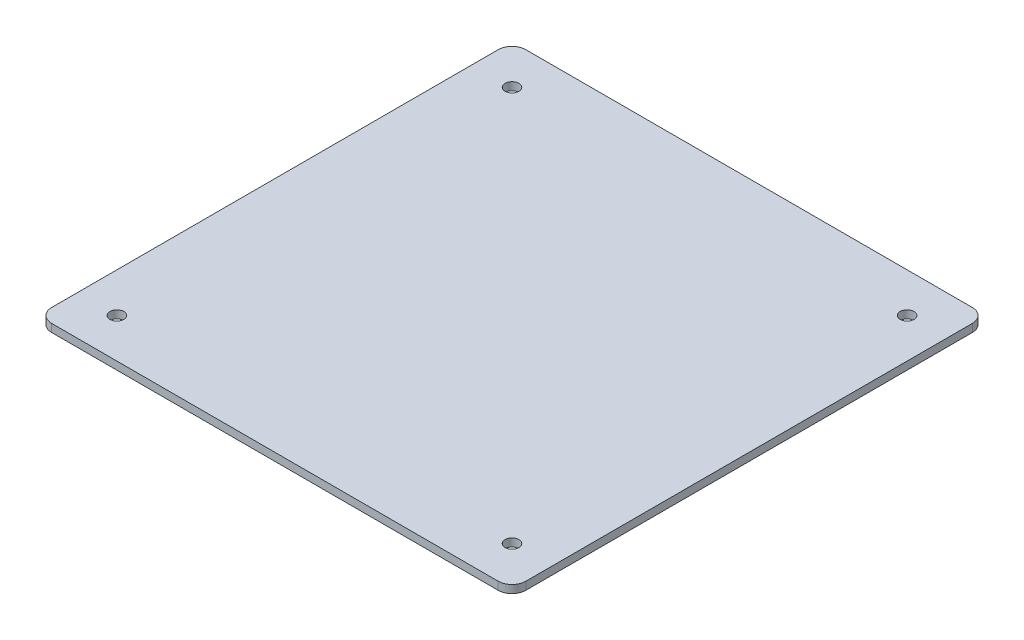
ISO-10303-21;
HEADER;
FILE_DESCRIPTION(('STEP AP214'),'2;1');
FILE_NAME('part.step','',(''),(''),'','','');
FILE_SCHEMA(('AUTOMOTIVE_DESIGN { 1 0 10303 214 1 1 1 1 }'));
ENDSEC;
DATA;
#1=APPLICATION_CONTEXT('core data for automotive mechanical design processes');
#2=APPLICATION_PROTOCOL_DEFINITION('international standard','automotive_design',2000,#1);
#3=PRODUCT_CONTEXT('',#1,'mechanical');
#4=PRODUCT('Part','Part','',(#3));
#5=PRODUCT_RELATED_PRODUCT_CATEGORY('part','',(#4));
#6=PRODUCT_DEFINITION_FORMATION('','',#4);
#7=PRODUCT_DEFINITION_CONTEXT('part definition',#1,'design');
#8=PRODUCT_DEFINITION('design','',#6,#7);
#9=PRODUCT_DEFINITION_SHAPE('','',#8);
#10=(LENGTH_UNIT() NAMED_UNIT(*) SI_UNIT(.MILLI.,.METRE.));
#11=(NAMED_UNIT(*) PLANE_ANGLE_UNIT() SI_UNIT($,.RADIAN.));
#12=(NAMED_UNIT(*) SI_UNIT($,.STERADIAN.) SOLID_ANGLE_UNIT());
#13=UNCERTAINTY_MEASURE_WITH_UNIT(LENGTH_MEASURE(1.E-05),#10,'distance_accuracy_value','');
#14=(GEOMETRIC_REPRESENTATION_CONTEXT(3) GLOBAL_UNCERTAINTY_ASSIGNED_CONTEXT((#13)) GLOBAL_UNIT_ASSIGNED_CONTEXT((#10,
#11,#12)) REPRESENTATION_CONTEXT('',''));
#15=CARTESIAN_POINT('',(0.,0.,0.));
#16=DIRECTION('',(0.,0.,1.));
#17=DIRECTION('',(1.,0.,0.));
#18=AXIS2_PLACEMENT_3D('',#15,#16,#17);
#19=CARTESIAN_POINT('',(60.,2.,-60.));
#20=DIRECTION('',(-1.,0.,0.));
#21=DIRECTION('',(0.,0.,1.));
#22=AXIS2_PLACEMENT_3D('',#19,#20,#21);
#23=PLANE('',#22);
#24=DIRECTION('',(0.,0.,-1.));
#25=VECTOR('',#24,1.);
#26=CARTESIAN_POINT('',(60.,0.,-60.));
#27=LINE('',#26,#25);
#28=CARTESIAN_POINT('',(60.,0.,56.5));
#29=VERTEX_POINT('',#28);
#30=CARTESIAN_POINT('',(60.,0.,-56.5));
#31=VERTEX_POINT('',#30);
#32=EDGE_CURVE('E130',#29,#31,#27,.T.);
#33=ORIENTED_EDGE('',*,*,#32,.T.);
#34=DIRECTION('',(0.,-1.,0.));
#35=VECTOR('',#34,1.);
#36=CARTESIAN_POINT('',(60.,2.,-56.5));
#37=LINE('',#36,#35);
#38=CARTESIAN_POINT('',(60.,2.,-56.5));
#39=VERTEX_POINT('',#38);
#40=EDGE_CURVE('E152',#31,#39,#37,.F.);
#41=ORIENTED_EDGE('',*,*,#40,.T.);
#42=DIRECTION('',(0.,0.,-1.));
#43=VECTOR('',#42,1.);
#44=CARTESIAN_POINT('',(60.,2.,-60.));
#45=LINE('',#44,#43);
#46=CARTESIAN_POINT('',(60.,2.,56.5));
#47=VERTEX_POINT('',#46);
#48=EDGE_CURVE('E128',#47,#39,#45,.T.);
#49=ORIENTED_EDGE('',*,*,#48,.F.);
#50=DIRECTION('',(0.,-1.,0.));
#51=VECTOR('',#50,1.);
#52=CARTESIAN_POINT('',(60.,2.,56.5));
#53=LINE('',#52,#51);
#54=EDGE_CURVE('E149',#47,#29,#53,.T.);
#55=ORIENTED_EDGE('',*,*,#54,.T.);
#56=EDGE_LOOP('',(#33,#41,#49,#55));
#57=FACE_BOUND('',#56,.T.);
#58=ADVANCED_FACE('F33',(#57),#23,.F.);
#59=CARTESIAN_POINT('',(-60.,2.,-60.));
#60=DIRECTION('',(0.,0.,1.));
#61=DIRECTION('',(1.,0.,0.));
#62=AXIS2_PLACEMENT_3D('',#59,#60,#61);
#63=PLANE('',#62);
#64=DIRECTION('',(-1.,0.,0.));
#65=VECTOR('',#64,1.);
#66=CARTESIAN_POINT('',(-60.,0.,-60.));
#67=LINE('',#66,#65);
#68=CARTESIAN_POINT('',(56.5,0.,-60.));
#69=VERTEX_POINT('',#68);
#70=CARTESIAN_POINT('',(-56.5,0.,-60.));
#71=VERTEX_POINT('',#70);
#72=EDGE_CURVE('E126',#69,#71,#67,.T.);
#73=ORIENTED_EDGE('',*,*,#72,.T.);
#74=DIRECTION('',(0.,-1.,0.));
#75=VECTOR('',#74,1.);
#76=CARTESIAN_POINT('',(-56.5,2.,-60.));
#77=LINE('',#76,#75);
#78=CARTESIAN_POINT('',(-56.5,2.,-60.));
#79=VERTEX_POINT('',#78);
#80=EDGE_CURVE('E104',#71,#79,#77,.F.);
#81=ORIENTED_EDGE('',*,*,#80,.T.);
#82=DIRECTION('',(-1.,0.,0.));
#83=VECTOR('',#82,1.);
#84=CARTESIAN_POINT('',(-60.,2.,-60.));
#85=LINE('',#84,#83);
#86=CARTESIAN_POINT('',(56.5,2.,-60.));
#87=VERTEX_POINT('',#86);
#88=EDGE_CURVE('E166',#87,#79,#85,.T.);
#89=ORIENTED_EDGE('',*,*,#88,.F.);
#90=DIRECTION('',(0.,-1.,0.));
#91=VECTOR('',#90,1.);
#92=CARTESIAN_POINT('',(56.5,2.,-60.));
#93=LINE('',#92,#91);
#94=EDGE_CURVE('E109',#87,#69,#93,.T.);
#95=ORIENTED_EDGE('',*,*,#94,.T.);
#96=EDGE_LOOP('',(#73,#81,#89,#95));
#97=FACE_BOUND('',#96,.T.);
#98=ADVANCED_FACE('F171',(#97),#63,.F.);
#99=CARTESIAN_POINT('',(-60.,2.,-60.));
#100=DIRECTION('',(1.,0.,0.));
#101=DIRECTION('',(0.,0.,-1.));
#102=AXIS2_PLACEMENT_3D('',#99,#100,#101);
#103=PLANE('',#102);
#104=DIRECTION('',(0.,0.,1.));
#105=VECTOR('',#104,1.);
#106=CARTESIAN_POINT('',(-60.,2.,-60.));
#107=LINE('',#106,#105);
#108=CARTESIAN_POINT('',(-60.,2.,-56.5));
#109=VERTEX_POINT('',#108);
#110=CARTESIAN_POINT('',(-60.,2.,56.5));
#111=VERTEX_POINT('',#110);
#112=EDGE_CURVE('E118',#109,#111,#107,.T.);
#113=ORIENTED_EDGE('',*,*,#112,.F.);
#114=DIRECTION('',(0.,-1.,0.));
#115=VECTOR('',#114,1.);
#116=CARTESIAN_POINT('',(-60.,2.,-56.5));
#117=LINE('',#116,#115);
#118=CARTESIAN_POINT('',(-60.,0.,-56.5));
#119=VERTEX_POINT('',#118);
#120=EDGE_CURVE('E103',#109,#119,#117,.T.);
#121=ORIENTED_EDGE('',*,*,#120,.T.);
#122=DIRECTION('',(0.,0.,1.));
#123=VECTOR('',#122,1.);
#124=CARTESIAN_POINT('',(-60.,0.,-60.));
#125=LINE('',#124,#123);
#126=CARTESIAN_POINT('',(-60.,0.,56.5));
#127=VERTEX_POINT('',#126);
#128=EDGE_CURVE('E116',#119,#127,#125,.T.);
#129=ORIENTED_EDGE('',*,*,#128,.T.);
#130=DIRECTION('',(0.,-1.,0.));
#131=VECTOR('',#130,1.);
#132=CARTESIAN_POINT('',(-60.,2.,56.5));
#133=LINE('',#132,#131);
#134=EDGE_CURVE('E120',#127,#111,#133,.F.);
#135=ORIENTED_EDGE('',*,*,#134,.T.);
#136=EDGE_LOOP('',(#113,#121,#129,#135));
#137=FACE_BOUND('',#136,.T.);
#138=ADVANCED_FACE('F115',(#137),#103,.F.);
#139=CARTESIAN_POINT('',(-60.,2.,60.));
#140=DIRECTION('',(0.,0.,-1.));
#141=DIRECTION('',(-1.,0.,0.));
#142=AXIS2_PLACEMENT_3D('',#139,#140,#141);
#143=PLANE('',#142);
#144=DIRECTION('',(1.,0.,0.));
#145=VECTOR('',#144,1.);
#146=CARTESIAN_POINT('',(-60.,2.,60.));
#147=LINE('',#146,#145);
#148=CARTESIAN_POINT('',(-56.5,2.,60.));
#149=VERTEX_POINT('',#148);
#150=CARTESIAN_POINT('',(56.5,2.,60.));
#151=VERTEX_POINT('',#150);
#152=EDGE_CURVE('E134',#149,#151,#147,.T.);
#153=ORIENTED_EDGE('',*,*,#152,.F.);
#154=DIRECTION('',(0.,-1.,0.));
#155=VECTOR('',#154,1.);
#156=CARTESIAN_POINT('',(-56.5,2.,60.));
#157=LINE('',#156,#155);
#158=CARTESIAN_POINT('',(-56.5,0.,60.));
#159=VERTEX_POINT('',#158);
#160=EDGE_CURVE('E11',#149,#159,#157,.T.);
#161=ORIENTED_EDGE('',*,*,#160,.T.);
#162=DIRECTION('',(1.,0.,0.));
#163=VECTOR('',#162,1.);
#164=CARTESIAN_POINT('',(-60.,0.,60.));
#165=LINE('',#164,#163);
#166=CARTESIAN_POINT('',(56.5,0.,60.));
#167=VERTEX_POINT('',#166);
#168=EDGE_CURVE('E125',#159,#167,#165,.T.);
#169=ORIENTED_EDGE('',*,*,#168,.T.);
#170=DIRECTION('',(0.,-1.,0.));
#171=VECTOR('',#170,1.);
#172=CARTESIAN_POINT('',(56.5,2.,60.));
#173=LINE('',#172,#171);
#174=EDGE_CURVE('E41',#167,#151,#173,.F.);
#175=ORIENTED_EDGE('',*,*,#174,.T.);
#176=EDGE_LOOP('',(#153,#161,#169,#175));
#177=FACE_BOUND('',#176,.T.);
#178=ADVANCED_FACE('F213',(#177),#143,.F.);
#179=CARTESIAN_POINT('',(0.,2.,0.));
#180=DIRECTION('',(0.,1.,0.));
#181=DIRECTION('',(0.,0.,1.));
#182=AXIS2_PLACEMENT_3D('',#179,#180,#181);
#183=PLANE('',#182);
#184=CARTESIAN_POINT('',(50.,2.,-50.));
#185=DIRECTION('',(0.,1.,0.));
#186=DIRECTION('',(0.,0.,-1.));
#187=AXIS2_PLACEMENT_3D('',#184,#185,#186);
#188=CIRCLE('',#187,1.74999999999998);
#189=CARTESIAN_POINT('',(50.,2.,-51.75));
#190=VERTEX_POINT('',#189);
#191=EDGE_CURVE('E183',#190,#190,#188,.T.);
#192=ORIENTED_EDGE('',*,*,#191,.F.);
#193=EDGE_LOOP('',(#192));
#194=FACE_BOUND('',#193,.T.);
#195=CARTESIAN_POINT('',(50.,2.,50.));
#196=DIRECTION('',(0.,1.,0.));
#197=DIRECTION('',(0.,0.,1.));
#198=AXIS2_PLACEMENT_3D('',#195,#196,#197);
#199=CIRCLE('',#198,1.74999999999999);
#200=CARTESIAN_POINT('',(50.,2.,51.75));
#201=VERTEX_POINT('',#200);
#202=EDGE_CURVE('E189',#201,#201,#199,.T.);
#203=ORIENTED_EDGE('',*,*,#202,.F.);
#204=EDGE_LOOP('',(#203));
#205=FACE_BOUND('',#204,.T.);
#206=CARTESIAN_POINT('',(-50.,2.,50.));
#207=DIRECTION('',(0.,1.,0.));
#208=DIRECTION('',(0.,0.,-1.));
#209=AXIS2_PLACEMENT_3D('',#206,#207,#208);
#210=CIRCLE('',#209,1.74999999999999);
#211=CARTESIAN_POINT('',(-50.,2.,48.25));
#212=VERTEX_POINT('',#211);
#213=EDGE_CURVE('E195',#212,#212,#210,.T.);
#214=ORIENTED_EDGE('',*,*,#213,.F.);
#215=EDGE_LOOP('',(#214));
#216=FACE_BOUND('',#215,.T.);
#217=CARTESIAN_POINT('',(-50.,2.,-50.));
#218=DIRECTION('',(0.,1.,0.));
#219=DIRECTION('',(0.,0.,1.));
#220=AXIS2_PLACEMENT_3D('',#217,#218,#219);
#221=CIRCLE('',#220,1.75);
#222=CARTESIAN_POINT('',(-50.,2.,-48.25));
#223=VERTEX_POINT('',#222);
#224=EDGE_CURVE('E174',#223,#223,#221,.T.);
#225=ORIENTED_EDGE('',*,*,#224,.F.);
#226=EDGE_LOOP('',(#225));
#227=FACE_BOUND('',#226,.T.);
#228=ORIENTED_EDGE('',*,*,#88,.T.);
#229=CARTESIAN_POINT('',(-56.5,2.,-56.5));
#230=DIRECTION('',(0.,1.,0.));
#231=DIRECTION('',(0.,0.,1.));
#232=AXIS2_PLACEMENT_3D('',#229,#230,#231);
#233=CIRCLE('',#232,3.5);
#234=EDGE_CURVE('E147',#79,#109,#233,.T.);
#235=ORIENTED_EDGE('',*,*,#234,.T.);
#236=ORIENTED_EDGE('',*,*,#112,.T.);
#237=CARTESIAN_POINT('',(-56.5,2.,56.5));
#238=DIRECTION('',(0.,1.,0.));
#239=DIRECTION('',(0.,0.,1.));
#240=AXIS2_PLACEMENT_3D('',#237,#238,#239);
#241=CIRCLE('',#240,3.5);
#242=EDGE_CURVE('E54',#111,#149,#241,.T.);
#243=ORIENTED_EDGE('',*,*,#242,.T.);
#244=ORIENTED_EDGE('',*,*,#152,.T.);
#245=CARTESIAN_POINT('',(56.5,2.,56.5));
#246=DIRECTION('',(0.,1.,0.));
#247=DIRECTION('',(0.,0.,1.));
#248=AXIS2_PLACEMENT_3D('',#245,#246,#247);
#249=CIRCLE('',#248,3.5);
#250=EDGE_CURVE('E142',#151,#47,#249,.T.);
#251=ORIENTED_EDGE('',*,*,#250,.T.);
#252=ORIENTED_EDGE('',*,*,#48,.T.);
#253=CARTESIAN_POINT('',(56.5,2.,-56.5));
#254=DIRECTION('',(0.,1.,0.));
#255=DIRECTION('',(0.,0.,1.));
#256=AXIS2_PLACEMENT_3D('',#253,#254,#255);
#257=CIRCLE('',#256,3.5);
#258=EDGE_CURVE('E145',#39,#87,#257,.T.);
#259=ORIENTED_EDGE('',*,*,#258,.T.);
#260=EDGE_LOOP('',(#228,#235,#236,#243,#244,#251,#252,#259));
#261=FACE_BOUND('',#260,.T.);
#262=ADVANCED_FACE('F163',(#194,#205,#216,#227,#261),#183,.T.);
#263=CARTESIAN_POINT('',(0.,0.,0.));
#264=DIRECTION('',(0.,1.,0.));
#265=DIRECTION('',(0.,0.,1.));
#266=AXIS2_PLACEMENT_3D('',#263,#264,#265);
#267=PLANE('',#266);
#268=CARTESIAN_POINT('',(50.,0.,-50.));
#269=DIRECTION('',(0.,1.,0.));
#270=DIRECTION('',(0.,0.,-1.));
#271=AXIS2_PLACEMENT_3D('',#268,#269,#270);
#272=CIRCLE('',#271,1.74999999999998);
#273=CARTESIAN_POINT('',(50.,0.,-51.75));
#274=VERTEX_POINT('',#273);
#275=EDGE_CURVE('E186',#274,#274,#272,.T.);
#276=ORIENTED_EDGE('',*,*,#275,.T.);
#277=EDGE_LOOP('',(#276));
#278=FACE_BOUND('',#277,.T.);
#279=CARTESIAN_POINT('',(50.,0.,50.));
#280=DIRECTION('',(0.,1.,0.));
#281=DIRECTION('',(0.,0.,1.));
#282=AXIS2_PLACEMENT_3D('',#279,#280,#281);
#283=CIRCLE('',#282,1.74999999999999);
#284=CARTESIAN_POINT('',(50.,0.,51.75));
#285=VERTEX_POINT('',#284);
#286=EDGE_CURVE('E192',#285,#285,#283,.T.);
#287=ORIENTED_EDGE('',*,*,#286,.T.);
#288=EDGE_LOOP('',(#287));
#289=FACE_BOUND('',#288,.T.);
#290=CARTESIAN_POINT('',(-50.,0.,50.));
#291=DIRECTION('',(0.,1.,0.));
#292=DIRECTION('',(0.,0.,-1.));
#293=AXIS2_PLACEMENT_3D('',#290,#291,#292);
#294=CIRCLE('',#293,1.74999999999999);
#295=CARTESIAN_POINT('',(-50.,0.,48.25));
#296=VERTEX_POINT('',#295);
#297=EDGE_CURVE('E181',#296,#296,#294,.T.);
#298=ORIENTED_EDGE('',*,*,#297,.T.);
#299=EDGE_LOOP('',(#298));
#300=FACE_BOUND('',#299,.T.);
#301=CARTESIAN_POINT('',(-50.,0.,-50.));
#302=DIRECTION('',(0.,1.,0.));
#303=DIRECTION('',(0.,0.,1.));
#304=AXIS2_PLACEMENT_3D('',#301,#302,#303);
#305=CIRCLE('',#304,1.75);
#306=CARTESIAN_POINT('',(-50.,0.,-48.25));
#307=VERTEX_POINT('',#306);
#308=EDGE_CURVE('E172',#307,#307,#305,.T.);
#309=ORIENTED_EDGE('',*,*,#308,.T.);
#310=EDGE_LOOP('',(#309));
#311=FACE_BOUND('',#310,.T.);
#312=ORIENTED_EDGE('',*,*,#128,.F.);
#313=CARTESIAN_POINT('',(-56.5,0.,-56.5));
#314=DIRECTION('',(0.,1.,0.));
#315=DIRECTION('',(0.,0.,1.));
#316=AXIS2_PLACEMENT_3D('',#313,#314,#315);
#317=CIRCLE('',#316,3.5);
#318=EDGE_CURVE('E99',#119,#71,#317,.F.);
#319=ORIENTED_EDGE('',*,*,#318,.T.);
#320=ORIENTED_EDGE('',*,*,#72,.F.);
#321=CARTESIAN_POINT('',(56.5,0.,-56.5));
#322=DIRECTION('',(0.,1.,0.));
#323=DIRECTION('',(0.,0.,1.));
#324=AXIS2_PLACEMENT_3D('',#321,#322,#323);
#325=CIRCLE('',#324,3.5);
#326=EDGE_CURVE('E110',#69,#31,#325,.F.);
#327=ORIENTED_EDGE('',*,*,#326,.T.);
#328=ORIENTED_EDGE('',*,*,#32,.F.);
#329=CARTESIAN_POINT('',(56.5,0.,56.5));
#330=DIRECTION('',(0.,1.,0.));
#331=DIRECTION('',(0.,0.,1.));
#332=AXIS2_PLACEMENT_3D('',#329,#330,#331);
#333=CIRCLE('',#332,3.5);
#334=EDGE_CURVE('E119',#29,#167,#333,.F.);
#335=ORIENTED_EDGE('',*,*,#334,.T.);
#336=ORIENTED_EDGE('',*,*,#168,.F.);
#337=CARTESIAN_POINT('',(-56.5,0.,56.5));
#338=DIRECTION('',(0.,1.,0.));
#339=DIRECTION('',(0.,0.,1.));
#340=AXIS2_PLACEMENT_3D('',#337,#338,#339);
#341=CIRCLE('',#340,3.5);
#342=EDGE_CURVE('E124',#159,#127,#341,.F.);
#343=ORIENTED_EDGE('',*,*,#342,.T.);
#344=EDGE_LOOP('',(#312,#319,#320,#327,#328,#335,#336,#343));
#345=FACE_BOUND('',#344,.T.);
#346=ADVANCED_FACE('F122',(#278,#289,#300,#311,#345),#267,.F.);
#347=CARTESIAN_POINT('',(-56.5,2.,-56.5));
#348=DIRECTION('',(0.,-1.,0.));
#349=DIRECTION('',(0.,0.,-1.));
#350=AXIS2_PLACEMENT_3D('',#347,#348,#349);
#351=CYLINDRICAL_SURFACE('',#350,3.5);
#352=ORIENTED_EDGE('',*,*,#234,.F.);
#353=ORIENTED_EDGE('',*,*,#80,.F.);
#354=ORIENTED_EDGE('',*,*,#318,.F.);
#355=ORIENTED_EDGE('',*,*,#120,.F.);
#356=EDGE_LOOP('',(#352,#353,#354,#355));
#357=FACE_BOUND('',#356,.T.);
#358=ADVANCED_FACE('F102',(#357),#351,.T.);
#359=CARTESIAN_POINT('',(56.5,2.,-56.5));
#360=DIRECTION('',(0.,-1.,0.));
#361=DIRECTION('',(0.,0.,-1.));
#362=AXIS2_PLACEMENT_3D('',#359,#360,#361);
#363=CYLINDRICAL_SURFACE('',#362,3.5);
#364=ORIENTED_EDGE('',*,*,#258,.F.);
#365=ORIENTED_EDGE('',*,*,#40,.F.);
#366=ORIENTED_EDGE('',*,*,#326,.F.);
#367=ORIENTED_EDGE('',*,*,#94,.F.);
#368=EDGE_LOOP('',(#364,#365,#366,#367));
#369=FACE_BOUND('',#368,.T.);
#370=ADVANCED_FACE('F169',(#369),#363,.T.);
#371=CARTESIAN_POINT('',(-56.5,2.,56.5));
#372=DIRECTION('',(0.,-1.,0.));
#373=DIRECTION('',(0.,0.,-1.));
#374=AXIS2_PLACEMENT_3D('',#371,#372,#373);
#375=CYLINDRICAL_SURFACE('',#374,3.5);
#376=ORIENTED_EDGE('',*,*,#242,.F.);
#377=ORIENTED_EDGE('',*,*,#134,.F.);
#378=ORIENTED_EDGE('',*,*,#342,.F.);
#379=ORIENTED_EDGE('',*,*,#160,.F.);
#380=EDGE_LOOP('',(#376,#377,#378,#379));
#381=FACE_BOUND('',#380,.T.);
#382=ADVANCED_FACE('F224',(#381),#375,.T.);
#383=CARTESIAN_POINT('',(56.5,2.,56.5));
#384=DIRECTION('',(0.,-1.,0.));
#385=DIRECTION('',(0.,0.,-1.));
#386=AXIS2_PLACEMENT_3D('',#383,#384,#385);
#387=CYLINDRICAL_SURFACE('',#386,3.5);
#388=ORIENTED_EDGE('',*,*,#250,.F.);
#389=ORIENTED_EDGE('',*,*,#174,.F.);
#390=ORIENTED_EDGE('',*,*,#334,.F.);
#391=ORIENTED_EDGE('',*,*,#54,.F.);
#392=EDGE_LOOP('',(#388,#389,#390,#391));
#393=FACE_BOUND('',#392,.T.);
#394=ADVANCED_FACE('F35',(#393),#387,.T.);
#395=CARTESIAN_POINT('',(-50.,0.,-50.));
#396=DIRECTION('',(0.,1.,0.));
#397=DIRECTION('',(0.,0.,1.));
#398=AXIS2_PLACEMENT_3D('',#395,#396,#397);
#399=CYLINDRICAL_SURFACE('',#398,1.75);
#400=ORIENTED_EDGE('',*,*,#308,.F.);
#401=EDGE_LOOP('',(#400));
#402=FACE_BOUND('',#401,.T.);
#403=ORIENTED_EDGE('',*,*,#224,.T.);
#404=EDGE_LOOP('',(#403));
#405=FACE_BOUND('',#404,.T.);
#406=ADVANCED_FACE('F207',(#402,#405),#399,.F.);
#407=CARTESIAN_POINT('',(-50.,0.,50.));
#408=DIRECTION('',(0.,1.,0.));
#409=DIRECTION('',(0.,0.,1.));
#410=AXIS2_PLACEMENT_3D('',#407,#408,#409);
#411=CYLINDRICAL_SURFACE('',#410,1.74999999999999);
#412=ORIENTED_EDGE('',*,*,#297,.F.);
#413=EDGE_LOOP('',(#412));
#414=FACE_BOUND('',#413,.T.);
#415=ORIENTED_EDGE('',*,*,#213,.T.);
#416=EDGE_LOOP('',(#415));
#417=FACE_BOUND('',#416,.T.);
#418=ADVANCED_FACE('F203',(#414,#417),#411,.F.);
#419=CARTESIAN_POINT('',(50.,0.,50.));
#420=DIRECTION('',(0.,1.,0.));
#421=DIRECTION('',(0.,0.,1.));
#422=AXIS2_PLACEMENT_3D('',#419,#420,#421);
#423=CYLINDRICAL_SURFACE('',#422,1.74999999999999);
#424=ORIENTED_EDGE('',*,*,#286,.F.);
#425=EDGE_LOOP('',(#424));
#426=FACE_BOUND('',#425,.T.);
#427=ORIENTED_EDGE('',*,*,#202,.T.);
#428=EDGE_LOOP('',(#427));
#429=FACE_BOUND('',#428,.T.);
#430=ADVANCED_FACE('F206',(#426,#429),#423,.F.);
#431=CARTESIAN_POINT('',(50.,0.,-50.));
#432=DIRECTION('',(0.,1.,0.));
#433=DIRECTION('',(0.,0.,1.));
#434=AXIS2_PLACEMENT_3D('',#431,#432,#433);
#435=CYLINDRICAL_SURFACE('',#434,1.74999999999998);
#436=ORIENTED_EDGE('',*,*,#275,.F.);
#437=EDGE_LOOP('',(#436));
#438=FACE_BOUND('',#437,.T.);
#439=ORIENTED_EDGE('',*,*,#191,.T.);
#440=EDGE_LOOP('',(#439));
#441=FACE_BOUND('',#440,.T.);
#442=ADVANCED_FACE('F260',(#438,#441),#435,.F.);
#443=CLOSED_SHELL('',(#58,#98,#138,#178,#262,#346,#358,#370,#382,#394,#406,#418,#430,#442));
#444=MANIFOLD_SOLID_BREP('B2',#443);
#445=ADVANCED_BREP_SHAPE_REPRESENTATION('',(#18,#444),#14);
#446=SHAPE_DEFINITION_REPRESENTATION(#9,#445);
ENDSEC;
END-ISO-10303-21;
